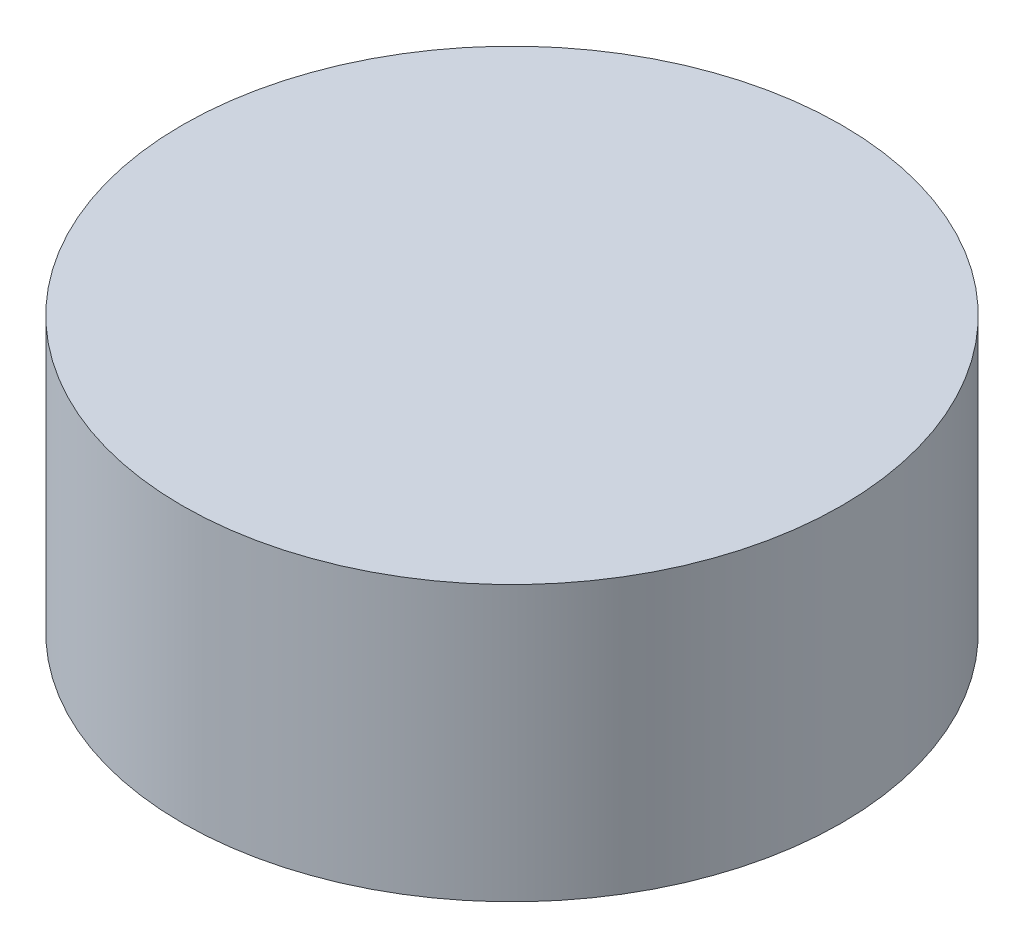
ISO-10303-21;
HEADER;
FILE_DESCRIPTION(('STEP AP214'),'2;1');
FILE_NAME('part.step','',(''),(''),'','','');
FILE_SCHEMA(('AUTOMOTIVE_DESIGN { 1 0 10303 214 1 1 1 1 }'));
ENDSEC;
DATA;
#1=APPLICATION_CONTEXT('core data for automotive mechanical design processes');
#2=APPLICATION_PROTOCOL_DEFINITION('international standard','automotive_design',2000,#1);
#3=PRODUCT_CONTEXT('',#1,'mechanical');
#4=PRODUCT('Part','Part','',(#3));
#5=PRODUCT_RELATED_PRODUCT_CATEGORY('part','',(#4));
#6=PRODUCT_DEFINITION_FORMATION('','',#4);
#7=PRODUCT_DEFINITION_CONTEXT('part definition',#1,'design');
#8=PRODUCT_DEFINITION('design','',#6,#7);
#9=PRODUCT_DEFINITION_SHAPE('','',#8);
#10=(LENGTH_UNIT() NAMED_UNIT(*) SI_UNIT(.MILLI.,.METRE.));
#11=(NAMED_UNIT(*) PLANE_ANGLE_UNIT() SI_UNIT($,.RADIAN.));
#12=(NAMED_UNIT(*) SI_UNIT($,.STERADIAN.) SOLID_ANGLE_UNIT());
#13=UNCERTAINTY_MEASURE_WITH_UNIT(LENGTH_MEASURE(1.E-05),#10,'distance_accuracy_value','');
#14=(GEOMETRIC_REPRESENTATION_CONTEXT(3) GLOBAL_UNCERTAINTY_ASSIGNED_CONTEXT((#13)) GLOBAL_UNIT_ASSIGNED_CONTEXT((#10,
#11,#12)) REPRESENTATION_CONTEXT('',''));
#15=CARTESIAN_POINT('',(0.,0.,0.));
#16=DIRECTION('',(0.,0.,1.));
#17=DIRECTION('',(1.,0.,0.));
#18=AXIS2_PLACEMENT_3D('',#15,#16,#17);
#19=CARTESIAN_POINT('',(0.,25.,0.));
#20=DIRECTION('',(0.,-1.,0.));
#21=DIRECTION('',(0.,0.,-1.));
#22=AXIS2_PLACEMENT_3D('',#19,#20,#21);
#23=CYLINDRICAL_SURFACE('',#22,30.);
#24=CARTESIAN_POINT('',(0.,25.,0.));
#25=DIRECTION('',(0.,1.,0.));
#26=DIRECTION('',(0.,0.,1.));
#27=AXIS2_PLACEMENT_3D('',#24,#25,#26);
#28=CIRCLE('',#27,30.);
#29=CARTESIAN_POINT('',(0.,25.,30.));
#30=VERTEX_POINT('',#29);
#31=EDGE_CURVE('E10',#30,#30,#28,.T.);
#32=ORIENTED_EDGE('',*,*,#31,.F.);
#33=EDGE_LOOP('',(#32));
#34=FACE_BOUND('',#33,.T.);
#35=CARTESIAN_POINT('',(0.,0.,0.));
#36=DIRECTION('',(0.,1.,0.));
#37=DIRECTION('',(0.,0.,1.));
#38=AXIS2_PLACEMENT_3D('',#35,#36,#37);
#39=CIRCLE('',#38,30.);
#40=CARTESIAN_POINT('',(0.,0.,30.));
#41=VERTEX_POINT('',#40);
#42=EDGE_CURVE('E34',#41,#41,#39,.T.);
#43=ORIENTED_EDGE('',*,*,#42,.T.);
#44=EDGE_LOOP('',(#43));
#45=FACE_BOUND('',#44,.T.);
#46=ADVANCED_FACE('F31',(#34,#45),#23,.T.);
#47=CARTESIAN_POINT('',(0.,25.,0.));
#48=DIRECTION('',(0.,1.,0.));
#49=DIRECTION('',(0.,0.,1.));
#50=AXIS2_PLACEMENT_3D('',#47,#48,#49);
#51=PLANE('',#50);
#52=ORIENTED_EDGE('',*,*,#31,.T.);
#53=EDGE_LOOP('',(#52));
#54=FACE_BOUND('',#53,.T.);
#55=ADVANCED_FACE('F46',(#54),#51,.T.);
#56=CARTESIAN_POINT('',(0.,0.,0.));
#57=DIRECTION('',(0.,1.,0.));
#58=DIRECTION('',(0.,0.,1.));
#59=AXIS2_PLACEMENT_3D('',#56,#57,#58);
#60=PLANE('',#59);
#61=ORIENTED_EDGE('',*,*,#42,.F.);
#62=EDGE_LOOP('',(#61));
#63=FACE_BOUND('',#62,.T.);
#64=ADVANCED_FACE('F44',(#63),#60,.F.);
#65=CLOSED_SHELL('',(#46,#55,#64));
#66=MANIFOLD_SOLID_BREP('B2',#65);
#67=ADVANCED_BREP_SHAPE_REPRESENTATION('',(#18,#66),#14);
#68=SHAPE_DEFINITION_REPRESENTATION(#9,#67);
ENDSEC;
END-ISO-10303-21;
